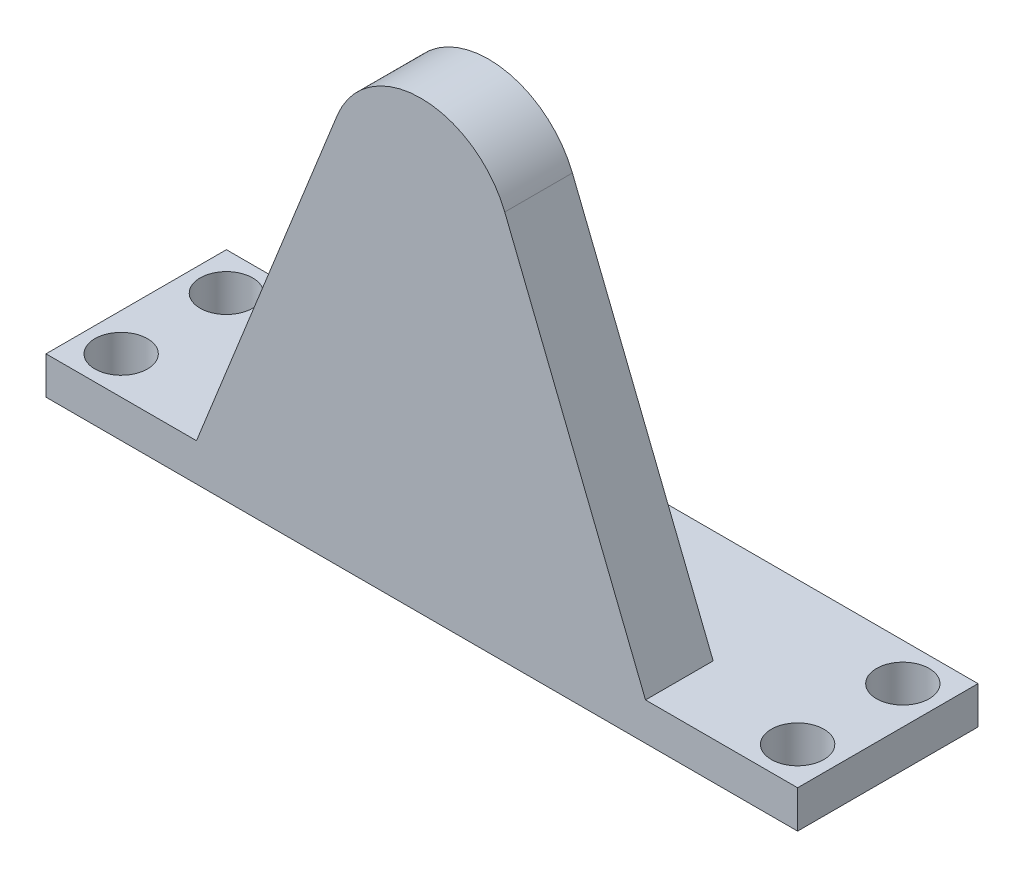
ISO-10303-21;
HEADER;
FILE_DESCRIPTION(('STEP AP214'),'2;1');
FILE_NAME('part.step','',(''),(''),'','','');
FILE_SCHEMA(('AUTOMOTIVE_DESIGN { 1 0 10303 214 1 1 1 1 }'));
ENDSEC;
DATA;
#1=APPLICATION_CONTEXT('core data for automotive mechanical design processes');
#2=APPLICATION_PROTOCOL_DEFINITION('international standard','automotive_design',2000,#1);
#3=PRODUCT_CONTEXT('',#1,'mechanical');
#4=PRODUCT('Part','Part','',(#3));
#5=PRODUCT_RELATED_PRODUCT_CATEGORY('part','',(#4));
#6=PRODUCT_DEFINITION_FORMATION('','',#4);
#7=PRODUCT_DEFINITION_CONTEXT('part definition',#1,'design');
#8=PRODUCT_DEFINITION('design','',#6,#7);
#9=PRODUCT_DEFINITION_SHAPE('','',#8);
#10=(LENGTH_UNIT() NAMED_UNIT(*) SI_UNIT(.MILLI.,.METRE.));
#11=(NAMED_UNIT(*) PLANE_ANGLE_UNIT() SI_UNIT($,.RADIAN.));
#12=(NAMED_UNIT(*) SI_UNIT($,.STERADIAN.) SOLID_ANGLE_UNIT());
#13=UNCERTAINTY_MEASURE_WITH_UNIT(LENGTH_MEASURE(1.E-05),#10,'distance_accuracy_value','');
#14=(GEOMETRIC_REPRESENTATION_CONTEXT(3) GLOBAL_UNCERTAINTY_ASSIGNED_CONTEXT((#13)) GLOBAL_UNIT_ASSIGNED_CONTEXT((#10,
#11,#12)) REPRESENTATION_CONTEXT('',''));
#15=CARTESIAN_POINT('',(0.,0.,0.));
#16=DIRECTION('',(0.,0.,1.));
#17=DIRECTION('',(1.,0.,0.));
#18=AXIS2_PLACEMENT_3D('',#15,#16,#17);
#19=CARTESIAN_POINT('',(0.,5.,0.));
#20=DIRECTION('',(0.,1.,0.));
#21=DIRECTION('',(0.,0.,1.));
#22=AXIS2_PLACEMENT_3D('',#19,#20,#21);
#23=PLANE('',#22);
#24=DIRECTION('',(0.,0.,-1.));
#25=VECTOR('',#24,1.);
#26=CARTESIAN_POINT('',(29.7635160139142,5.,12.));
#27=LINE('',#26,#25);
#28=CARTESIAN_POINT('',(29.7635160139142,5.,12.));
#29=VERTEX_POINT('',#28);
#30=CARTESIAN_POINT('',(29.7635160139142,5.,3.));
#31=VERTEX_POINT('',#30);
#32=EDGE_CURVE('E123',#29,#31,#27,.T.);
#33=ORIENTED_EDGE('',*,*,#32,.F.);
#34=DIRECTION('',(1.,0.,0.));
#35=VECTOR('',#34,1.);
#36=CARTESIAN_POINT('',(-50.,5.,12.));
#37=LINE('',#36,#35);
#38=CARTESIAN_POINT('',(50.,5.,12.));
#39=VERTEX_POINT('',#38);
#40=EDGE_CURVE('E131',#29,#39,#37,.T.);
#41=ORIENTED_EDGE('',*,*,#40,.T.);
#42=DIRECTION('',(0.,0.,-1.));
#43=VECTOR('',#42,1.);
#44=CARTESIAN_POINT('',(50.,5.,-12.));
#45=LINE('',#44,#43);
#46=CARTESIAN_POINT('',(50.,5.,-12.));
#47=VERTEX_POINT('',#46);
#48=EDGE_CURVE('E130',#39,#47,#45,.T.);
#49=ORIENTED_EDGE('',*,*,#48,.T.);
#50=DIRECTION('',(-1.,0.,0.));
#51=VECTOR('',#50,1.);
#52=CARTESIAN_POINT('',(-50.,5.,-12.));
#53=LINE('',#52,#51);
#54=CARTESIAN_POINT('',(-50.,5.,-12.));
#55=VERTEX_POINT('',#54);
#56=EDGE_CURVE('E60',#47,#55,#53,.T.);
#57=ORIENTED_EDGE('',*,*,#56,.T.);
#58=DIRECTION('',(0.,0.,1.));
#59=VECTOR('',#58,1.);
#60=CARTESIAN_POINT('',(-50.,5.,-12.));
#61=LINE('',#60,#59);
#62=CARTESIAN_POINT('',(-50.,5.,12.));
#63=VERTEX_POINT('',#62);
#64=EDGE_CURVE('E128',#55,#63,#61,.T.);
#65=ORIENTED_EDGE('',*,*,#64,.T.);
#66=CARTESIAN_POINT('',(-29.9780216951291,5.,12.));
#67=VERTEX_POINT('',#66);
#68=EDGE_CURVE('E88',#63,#67,#37,.T.);
#69=ORIENTED_EDGE('',*,*,#68,.T.);
#70=DIRECTION('',(0.,0.,-1.));
#71=VECTOR('',#70,1.);
#72=CARTESIAN_POINT('',(-29.9780216951291,5.,12.));
#73=LINE('',#72,#71);
#74=CARTESIAN_POINT('',(-29.9780216951291,5.,3.));
#75=VERTEX_POINT('',#74);
#76=EDGE_CURVE('E119',#67,#75,#73,.T.);
#77=ORIENTED_EDGE('',*,*,#76,.T.);
#78=DIRECTION('',(1.,0.,0.));
#79=VECTOR('',#78,1.);
#80=CARTESIAN_POINT('',(-29.9780216951291,5.,3.));
#81=LINE('',#80,#79);
#82=EDGE_CURVE('E227',#75,#31,#81,.T.);
#83=ORIENTED_EDGE('',*,*,#82,.T.);
#84=EDGE_LOOP('',(#33,#41,#49,#57,#65,#69,#77,#83));
#85=FACE_BOUND('',#84,.T.);
#86=CARTESIAN_POINT('',(44.9999999999999,5.,-7.00000000000003));
#87=DIRECTION('',(0.,1.,0.));
#88=DIRECTION('',(0.,0.,-1.));
#89=AXIS2_PLACEMENT_3D('',#86,#87,#88);
#90=CIRCLE('',#89,3.5);
#91=CARTESIAN_POINT('',(44.9999999999999,5.,-10.5));
#92=VERTEX_POINT('',#91);
#93=EDGE_CURVE('E259',#92,#92,#90,.T.);
#94=ORIENTED_EDGE('',*,*,#93,.F.);
#95=EDGE_LOOP('',(#94));
#96=FACE_BOUND('',#95,.T.);
#97=CARTESIAN_POINT('',(-45.,5.,-7.));
#98=DIRECTION('',(0.,1.,0.));
#99=DIRECTION('',(0.,0.,1.));
#100=AXIS2_PLACEMENT_3D('',#97,#98,#99);
#101=CIRCLE('',#100,3.5);
#102=CARTESIAN_POINT('',(-45.,5.,-3.5));
#103=VERTEX_POINT('',#102);
#104=EDGE_CURVE('E148',#103,#103,#101,.T.);
#105=ORIENTED_EDGE('',*,*,#104,.F.);
#106=EDGE_LOOP('',(#105));
#107=FACE_BOUND('',#106,.T.);
#108=CARTESIAN_POINT('',(-45.,5.,7.));
#109=DIRECTION('',(0.,1.,0.));
#110=DIRECTION('',(0.,0.,1.));
#111=AXIS2_PLACEMENT_3D('',#108,#109,#110);
#112=CIRCLE('',#111,3.5);
#113=CARTESIAN_POINT('',(-45.,5.,10.5));
#114=VERTEX_POINT('',#113);
#115=EDGE_CURVE('E265',#114,#114,#112,.T.);
#116=ORIENTED_EDGE('',*,*,#115,.F.);
#117=EDGE_LOOP('',(#116));
#118=FACE_BOUND('',#117,.T.);
#119=CARTESIAN_POINT('',(45.,5.,6.99999999999997));
#120=DIRECTION('',(0.,1.,0.));
#121=DIRECTION('',(0.,0.,-1.));
#122=AXIS2_PLACEMENT_3D('',#119,#120,#121);
#123=CIRCLE('',#122,3.5);
#124=CARTESIAN_POINT('',(45.,5.,3.49999999999997));
#125=VERTEX_POINT('',#124);
#126=EDGE_CURVE('E244',#125,#125,#123,.T.);
#127=ORIENTED_EDGE('',*,*,#126,.F.);
#128=EDGE_LOOP('',(#127));
#129=FACE_BOUND('',#128,.T.);
#130=ADVANCED_FACE('F34',(#85,#96,#107,#118,#129),#23,.T.);
#131=CARTESIAN_POINT('',(0.,0.,0.));
#132=DIRECTION('',(0.,1.,0.));
#133=DIRECTION('',(0.,0.,1.));
#134=AXIS2_PLACEMENT_3D('',#131,#132,#133);
#135=PLANE('',#134);
#136=CARTESIAN_POINT('',(44.9999999999999,0.,-7.00000000000003));
#137=DIRECTION('',(0.,1.,0.));
#138=DIRECTION('',(0.,0.,-1.));
#139=AXIS2_PLACEMENT_3D('',#136,#137,#138);
#140=CIRCLE('',#139,3.5);
#141=CARTESIAN_POINT('',(44.9999999999999,0.,-10.5));
#142=VERTEX_POINT('',#141);
#143=EDGE_CURVE('E256',#142,#142,#140,.T.);
#144=ORIENTED_EDGE('',*,*,#143,.T.);
#145=EDGE_LOOP('',(#144));
#146=FACE_BOUND('',#145,.T.);
#147=CARTESIAN_POINT('',(-45.,0.,-7.));
#148=DIRECTION('',(0.,1.,0.));
#149=DIRECTION('',(0.,0.,1.));
#150=AXIS2_PLACEMENT_3D('',#147,#148,#149);
#151=CIRCLE('',#150,3.5);
#152=CARTESIAN_POINT('',(-45.,0.,-3.5));
#153=VERTEX_POINT('',#152);
#154=EDGE_CURVE('E268',#153,#153,#151,.T.);
#155=ORIENTED_EDGE('',*,*,#154,.T.);
#156=EDGE_LOOP('',(#155));
#157=FACE_BOUND('',#156,.T.);
#158=DIRECTION('',(0.,0.,1.));
#159=VECTOR('',#158,1.);
#160=CARTESIAN_POINT('',(-50.,0.,-12.));
#161=LINE('',#160,#159);
#162=CARTESIAN_POINT('',(-50.,0.,-12.));
#163=VERTEX_POINT('',#162);
#164=CARTESIAN_POINT('',(-50.,0.,12.));
#165=VERTEX_POINT('',#164);
#166=EDGE_CURVE('E144',#163,#165,#161,.T.);
#167=ORIENTED_EDGE('',*,*,#166,.F.);
#168=DIRECTION('',(-1.,0.,0.));
#169=VECTOR('',#168,1.);
#170=CARTESIAN_POINT('',(-50.,0.,-12.));
#171=LINE('',#170,#169);
#172=CARTESIAN_POINT('',(50.,0.,-12.));
#173=VERTEX_POINT('',#172);
#174=EDGE_CURVE('E81',#173,#163,#171,.T.);
#175=ORIENTED_EDGE('',*,*,#174,.F.);
#176=DIRECTION('',(0.,0.,-1.));
#177=VECTOR('',#176,1.);
#178=CARTESIAN_POINT('',(50.,0.,-12.));
#179=LINE('',#178,#177);
#180=CARTESIAN_POINT('',(50.,0.,12.));
#181=VERTEX_POINT('',#180);
#182=EDGE_CURVE('E150',#181,#173,#179,.T.);
#183=ORIENTED_EDGE('',*,*,#182,.F.);
#184=DIRECTION('',(1.,0.,0.));
#185=VECTOR('',#184,1.);
#186=CARTESIAN_POINT('',(-50.,0.,12.));
#187=LINE('',#186,#185);
#188=EDGE_CURVE('E147',#165,#181,#187,.T.);
#189=ORIENTED_EDGE('',*,*,#188,.F.);
#190=EDGE_LOOP('',(#167,#175,#183,#189));
#191=FACE_BOUND('',#190,.T.);
#192=CARTESIAN_POINT('',(-45.,0.,7.));
#193=DIRECTION('',(0.,1.,0.));
#194=DIRECTION('',(0.,0.,1.));
#195=AXIS2_PLACEMENT_3D('',#192,#193,#194);
#196=CIRCLE('',#195,3.5);
#197=CARTESIAN_POINT('',(-45.,0.,10.5));
#198=VERTEX_POINT('',#197);
#199=EDGE_CURVE('E262',#198,#198,#196,.T.);
#200=ORIENTED_EDGE('',*,*,#199,.T.);
#201=EDGE_LOOP('',(#200));
#202=FACE_BOUND('',#201,.T.);
#203=CARTESIAN_POINT('',(45.,0.,6.99999999999997));
#204=DIRECTION('',(0.,1.,0.));
#205=DIRECTION('',(0.,0.,-1.));
#206=AXIS2_PLACEMENT_3D('',#203,#204,#205);
#207=CIRCLE('',#206,3.5);
#208=CARTESIAN_POINT('',(45.,0.,3.49999999999997));
#209=VERTEX_POINT('',#208);
#210=EDGE_CURVE('E122',#209,#209,#207,.T.);
#211=ORIENTED_EDGE('',*,*,#210,.T.);
#212=EDGE_LOOP('',(#211));
#213=FACE_BOUND('',#212,.T.);
#214=ADVANCED_FACE('F165',(#146,#157,#191,#202,#213),#135,.F.);
#215=CARTESIAN_POINT('',(-50.,5.,-12.));
#216=DIRECTION('',(1.,0.,0.));
#217=DIRECTION('',(0.,0.,-1.));
#218=AXIS2_PLACEMENT_3D('',#215,#216,#217);
#219=PLANE('',#218);
#220=ORIENTED_EDGE('',*,*,#166,.T.);
#221=DIRECTION('',(0.,-1.,0.));
#222=VECTOR('',#221,1.);
#223=CARTESIAN_POINT('',(-50.,5.,12.));
#224=LINE('',#223,#222);
#225=EDGE_CURVE('E11',#63,#165,#224,.T.);
#226=ORIENTED_EDGE('',*,*,#225,.F.);
#227=ORIENTED_EDGE('',*,*,#64,.F.);
#228=DIRECTION('',(0.,-1.,0.));
#229=VECTOR('',#228,1.);
#230=CARTESIAN_POINT('',(-50.,5.,-12.));
#231=LINE('',#230,#229);
#232=EDGE_CURVE('E143',#55,#163,#231,.T.);
#233=ORIENTED_EDGE('',*,*,#232,.T.);
#234=EDGE_LOOP('',(#220,#226,#227,#233));
#235=FACE_BOUND('',#234,.T.);
#236=ADVANCED_FACE('F36',(#235),#219,.F.);
#237=CARTESIAN_POINT('',(-50.,5.,12.));
#238=DIRECTION('',(0.,0.,-1.));
#239=DIRECTION('',(-1.,0.,0.));
#240=AXIS2_PLACEMENT_3D('',#237,#238,#239);
#241=PLANE('',#240);
#242=ORIENTED_EDGE('',*,*,#188,.T.);
#243=DIRECTION('',(0.,-1.,0.));
#244=VECTOR('',#243,1.);
#245=CARTESIAN_POINT('',(50.,5.,12.));
#246=LINE('',#245,#244);
#247=EDGE_CURVE('E43',#39,#181,#246,.T.);
#248=ORIENTED_EDGE('',*,*,#247,.F.);
#249=ORIENTED_EDGE('',*,*,#40,.F.);
#250=DIRECTION('',(-0.371150568871562,0.928572697868248,0.));
#251=VECTOR('',#250,1.);
#252=CARTESIAN_POINT('',(11.0356195338116,51.854874593885,12.));
#253=LINE('',#252,#251);
#254=CARTESIAN_POINT('',(11.0356195338116,51.854874593885,12.));
#255=VERTEX_POINT('',#254);
#256=EDGE_CURVE('E115',#29,#255,#253,.T.);
#257=ORIENTED_EDGE('',*,*,#256,.T.);
#258=CARTESIAN_POINT('',(-0.10725284060744,47.4010677674266,12.));
#259=DIRECTION('',(0.,0.,1.));
#260=DIRECTION('',(1.,0.,0.));
#261=AXIS2_PLACEMENT_3D('',#258,#259,#260);
#262=CIRCLE('',#261,12.);
#263=CARTESIAN_POINT('',(-11.2501252150265,51.854874593885,12.));
#264=VERTEX_POINT('',#263);
#265=EDGE_CURVE('E113',#255,#264,#262,.T.);
#266=ORIENTED_EDGE('',*,*,#265,.T.);
#267=DIRECTION('',(-0.371150568871562,-0.928572697868248,0.));
#268=VECTOR('',#267,1.);
#269=CARTESIAN_POINT('',(-29.9780216951291,5.,12.));
#270=LINE('',#269,#268);
#271=EDGE_CURVE('E110',#264,#67,#270,.T.);
#272=ORIENTED_EDGE('',*,*,#271,.T.);
#273=ORIENTED_EDGE('',*,*,#68,.F.);
#274=ORIENTED_EDGE('',*,*,#225,.T.);
#275=EDGE_LOOP('',(#242,#248,#249,#257,#266,#272,#273,#274));
#276=FACE_BOUND('',#275,.T.);
#277=ADVANCED_FACE('F111',(#276),#241,.F.);
#278=CARTESIAN_POINT('',(50.,5.,-12.));
#279=DIRECTION('',(-1.,0.,0.));
#280=DIRECTION('',(0.,0.,1.));
#281=AXIS2_PLACEMENT_3D('',#278,#279,#280);
#282=PLANE('',#281);
#283=ORIENTED_EDGE('',*,*,#182,.T.);
#284=DIRECTION('',(0.,-1.,0.));
#285=VECTOR('',#284,1.);
#286=CARTESIAN_POINT('',(50.,5.,-12.));
#287=LINE('',#286,#285);
#288=EDGE_CURVE('E154',#47,#173,#287,.T.);
#289=ORIENTED_EDGE('',*,*,#288,.F.);
#290=ORIENTED_EDGE('',*,*,#48,.F.);
#291=ORIENTED_EDGE('',*,*,#247,.T.);
#292=EDGE_LOOP('',(#283,#289,#290,#291));
#293=FACE_BOUND('',#292,.T.);
#294=ADVANCED_FACE('F160',(#293),#282,.F.);
#295=CARTESIAN_POINT('',(-50.,5.,-12.));
#296=DIRECTION('',(0.,0.,1.));
#297=DIRECTION('',(1.,0.,0.));
#298=AXIS2_PLACEMENT_3D('',#295,#296,#297);
#299=PLANE('',#298);
#300=ORIENTED_EDGE('',*,*,#174,.T.);
#301=ORIENTED_EDGE('',*,*,#232,.F.);
#302=ORIENTED_EDGE('',*,*,#56,.F.);
#303=ORIENTED_EDGE('',*,*,#288,.T.);
#304=EDGE_LOOP('',(#300,#301,#302,#303));
#305=FACE_BOUND('',#304,.T.);
#306=ADVANCED_FACE('F168',(#305),#299,.F.);
#307=CARTESIAN_POINT('',(-45.,5.,-7.));
#308=DIRECTION('',(0.,-1.,0.));
#309=DIRECTION('',(0.,0.,-1.));
#310=AXIS2_PLACEMENT_3D('',#307,#308,#309);
#311=CYLINDRICAL_SURFACE('',#310,3.5);
#312=ORIENTED_EDGE('',*,*,#104,.T.);
#313=EDGE_LOOP('',(#312));
#314=FACE_BOUND('',#313,.T.);
#315=ORIENTED_EDGE('',*,*,#154,.F.);
#316=EDGE_LOOP('',(#315));
#317=FACE_BOUND('',#316,.T.);
#318=ADVANCED_FACE('F170',(#314,#317),#311,.F.);
#319=CARTESIAN_POINT('',(-45.,5.,7.));
#320=DIRECTION('',(0.,-1.,0.));
#321=DIRECTION('',(0.,0.,-1.));
#322=AXIS2_PLACEMENT_3D('',#319,#320,#321);
#323=CYLINDRICAL_SURFACE('',#322,3.5);
#324=ORIENTED_EDGE('',*,*,#115,.T.);
#325=EDGE_LOOP('',(#324));
#326=FACE_BOUND('',#325,.T.);
#327=ORIENTED_EDGE('',*,*,#199,.F.);
#328=EDGE_LOOP('',(#327));
#329=FACE_BOUND('',#328,.T.);
#330=ADVANCED_FACE('F176',(#326,#329),#323,.F.);
#331=CARTESIAN_POINT('',(44.9999999999999,5.,-7.00000000000003));
#332=DIRECTION('',(0.,-1.,0.));
#333=DIRECTION('',(0.,0.,-1.));
#334=AXIS2_PLACEMENT_3D('',#331,#332,#333);
#335=CYLINDRICAL_SURFACE('',#334,3.5);
#336=ORIENTED_EDGE('',*,*,#93,.T.);
#337=EDGE_LOOP('',(#336));
#338=FACE_BOUND('',#337,.T.);
#339=ORIENTED_EDGE('',*,*,#143,.F.);
#340=EDGE_LOOP('',(#339));
#341=FACE_BOUND('',#340,.T.);
#342=ADVANCED_FACE('F190',(#338,#341),#335,.F.);
#343=CARTESIAN_POINT('',(45.,5.,6.99999999999997));
#344=DIRECTION('',(0.,-1.,0.));
#345=DIRECTION('',(0.,0.,-1.));
#346=AXIS2_PLACEMENT_3D('',#343,#344,#345);
#347=CYLINDRICAL_SURFACE('',#346,3.5);
#348=ORIENTED_EDGE('',*,*,#126,.T.);
#349=EDGE_LOOP('',(#348));
#350=FACE_BOUND('',#349,.T.);
#351=ORIENTED_EDGE('',*,*,#210,.F.);
#352=EDGE_LOOP('',(#351));
#353=FACE_BOUND('',#352,.T.);
#354=ADVANCED_FACE('F194',(#350,#353),#347,.F.);
#355=CARTESIAN_POINT('',(-29.9780216951291,5.,12.));
#356=DIRECTION('',(0.928572697868248,-0.371150568871562,0.));
#357=DIRECTION('',(0.371150568871562,0.928572697868248,0.));
#358=AXIS2_PLACEMENT_3D('',#355,#356,#357);
#359=PLANE('',#358);
#360=DIRECTION('',(-0.371150568871562,-0.928572697868248,0.));
#361=VECTOR('',#360,1.);
#362=CARTESIAN_POINT('',(-29.9780216951291,5.,3.));
#363=LINE('',#362,#361);
#364=CARTESIAN_POINT('',(-11.2501252150265,51.854874593885,3.));
#365=VERTEX_POINT('',#364);
#366=EDGE_CURVE('E51',#365,#75,#363,.T.);
#367=ORIENTED_EDGE('',*,*,#366,.T.);
#368=ORIENTED_EDGE('',*,*,#76,.F.);
#369=ORIENTED_EDGE('',*,*,#271,.F.);
#370=DIRECTION('',(0.,0.,-1.));
#371=VECTOR('',#370,1.);
#372=CARTESIAN_POINT('',(-11.2501252150265,51.854874593885,12.));
#373=LINE('',#372,#371);
#374=EDGE_CURVE('E232',#264,#365,#373,.T.);
#375=ORIENTED_EDGE('',*,*,#374,.T.);
#376=EDGE_LOOP('',(#367,#368,#369,#375));
#377=FACE_BOUND('',#376,.T.);
#378=ADVANCED_FACE('F120',(#377),#359,.F.);
#379=CARTESIAN_POINT('',(11.0356195338116,51.854874593885,12.));
#380=DIRECTION('',(-0.928572697868248,-0.371150568871562,0.));
#381=DIRECTION('',(0.371150568871562,-0.928572697868248,0.));
#382=AXIS2_PLACEMENT_3D('',#379,#380,#381);
#383=PLANE('',#382);
#384=DIRECTION('',(-0.371150568871562,0.928572697868248,0.));
#385=VECTOR('',#384,1.);
#386=CARTESIAN_POINT('',(11.0356195338116,51.854874593885,3.));
#387=LINE('',#386,#385);
#388=CARTESIAN_POINT('',(11.0356195338116,51.854874593885,3.));
#389=VERTEX_POINT('',#388);
#390=EDGE_CURVE('E235',#31,#389,#387,.T.);
#391=ORIENTED_EDGE('',*,*,#390,.T.);
#392=DIRECTION('',(0.,0.,-1.));
#393=VECTOR('',#392,1.);
#394=CARTESIAN_POINT('',(11.0356195338116,51.854874593885,12.));
#395=LINE('',#394,#393);
#396=EDGE_CURVE('E239',#255,#389,#395,.T.);
#397=ORIENTED_EDGE('',*,*,#396,.F.);
#398=ORIENTED_EDGE('',*,*,#256,.F.);
#399=ORIENTED_EDGE('',*,*,#32,.T.);
#400=EDGE_LOOP('',(#391,#397,#398,#399));
#401=FACE_BOUND('',#400,.T.);
#402=ADVANCED_FACE('F201',(#401),#383,.F.);
#403=CARTESIAN_POINT('',(-0.10725284060744,47.4010677674266,12.));
#404=DIRECTION('',(0.,0.,-1.));
#405=DIRECTION('',(-1.,0.,0.));
#406=AXIS2_PLACEMENT_3D('',#403,#404,#405);
#407=CYLINDRICAL_SURFACE('',#406,12.);
#408=CARTESIAN_POINT('',(-0.10725284060744,47.4010677674266,3.));
#409=DIRECTION('',(0.,0.,1.));
#410=DIRECTION('',(1.,0.,0.));
#411=AXIS2_PLACEMENT_3D('',#408,#409,#410);
#412=CIRCLE('',#411,12.);
#413=EDGE_CURVE('E116',#389,#365,#412,.T.);
#414=ORIENTED_EDGE('',*,*,#413,.T.);
#415=ORIENTED_EDGE('',*,*,#374,.F.);
#416=ORIENTED_EDGE('',*,*,#265,.F.);
#417=ORIENTED_EDGE('',*,*,#396,.T.);
#418=EDGE_LOOP('',(#414,#415,#416,#417));
#419=FACE_BOUND('',#418,.T.);
#420=ADVANCED_FACE('F204',(#419),#407,.T.);
#421=CARTESIAN_POINT('',(-0.10725284060744,47.4010677674266,3.));
#422=DIRECTION('',(0.,0.,1.));
#423=DIRECTION('',(1.,0.,0.));
#424=AXIS2_PLACEMENT_3D('',#421,#422,#423);
#425=PLANE('',#424);
#426=CARTESIAN_POINT('',(0.,49.5782790739777,3.));
#427=DIRECTION('',(0.,0.,-1.));
#428=DIRECTION('',(-1.,0.,0.));
#429=AXIS2_PLACEMENT_3D('',#426,#427,#428);
#430=CIRCLE('',#429,8.);
#431=CARTESIAN_POINT('',(-8.,49.5782790739777,3.));
#432=VERTEX_POINT('',#431);
#433=EDGE_CURVE('E225',#432,#432,#430,.T.);
#434=ORIENTED_EDGE('',*,*,#433,.F.);
#435=EDGE_LOOP('',(#434));
#436=FACE_BOUND('',#435,.T.);
#437=ORIENTED_EDGE('',*,*,#366,.F.);
#438=ORIENTED_EDGE('',*,*,#413,.F.);
#439=ORIENTED_EDGE('',*,*,#390,.F.);
#440=ORIENTED_EDGE('',*,*,#82,.F.);
#441=EDGE_LOOP('',(#437,#438,#439,#440));
#442=FACE_BOUND('',#441,.T.);
#443=ADVANCED_FACE('F208',(#436,#442),#425,.F.);
#444=CARTESIAN_POINT('',(0.,49.5782790739777,7.));
#445=DIRECTION('',(0.,0.,-1.));
#446=DIRECTION('',(-1.,0.,0.));
#447=AXIS2_PLACEMENT_3D('',#444,#445,#446);
#448=CYLINDRICAL_SURFACE('',#447,8.);
#449=CARTESIAN_POINT('',(0.,49.5782790739777,7.));
#450=DIRECTION('',(0.,0.,-1.));
#451=DIRECTION('',(-1.,0.,0.));
#452=AXIS2_PLACEMENT_3D('',#449,#450,#451);
#453=CIRCLE('',#452,8.);
#454=CARTESIAN_POINT('',(-8.,49.5782790739777,7.));
#455=VERTEX_POINT('',#454);
#456=EDGE_CURVE('E224',#455,#455,#453,.T.);
#457=ORIENTED_EDGE('',*,*,#456,.F.);
#458=EDGE_LOOP('',(#457));
#459=FACE_BOUND('',#458,.T.);
#460=ORIENTED_EDGE('',*,*,#433,.T.);
#461=EDGE_LOOP('',(#460));
#462=FACE_BOUND('',#461,.T.);
#463=ADVANCED_FACE('F212',(#459,#462),#448,.F.);
#464=CARTESIAN_POINT('',(0.,49.5782790739777,7.));
#465=DIRECTION('',(0.,0.,-1.));
#466=DIRECTION('',(-1.,0.,0.));
#467=AXIS2_PLACEMENT_3D('',#464,#465,#466);
#468=PLANE('',#467);
#469=ORIENTED_EDGE('',*,*,#456,.T.);
#470=EDGE_LOOP('',(#469));
#471=FACE_BOUND('',#470,.T.);
#472=ADVANCED_FACE('F216',(#471),#468,.T.);
#473=CLOSED_SHELL('',(#130,#214,#236,#277,#294,#306,#318,#330,#342,#354,#378,#402,#420,#443,
#463,#472));
#474=MANIFOLD_SOLID_BREP('B2',#473);
#475=ADVANCED_BREP_SHAPE_REPRESENTATION('',(#18,#474),#14);
#476=SHAPE_DEFINITION_REPRESENTATION(#9,#475);
ENDSEC;
END-ISO-10303-21;
